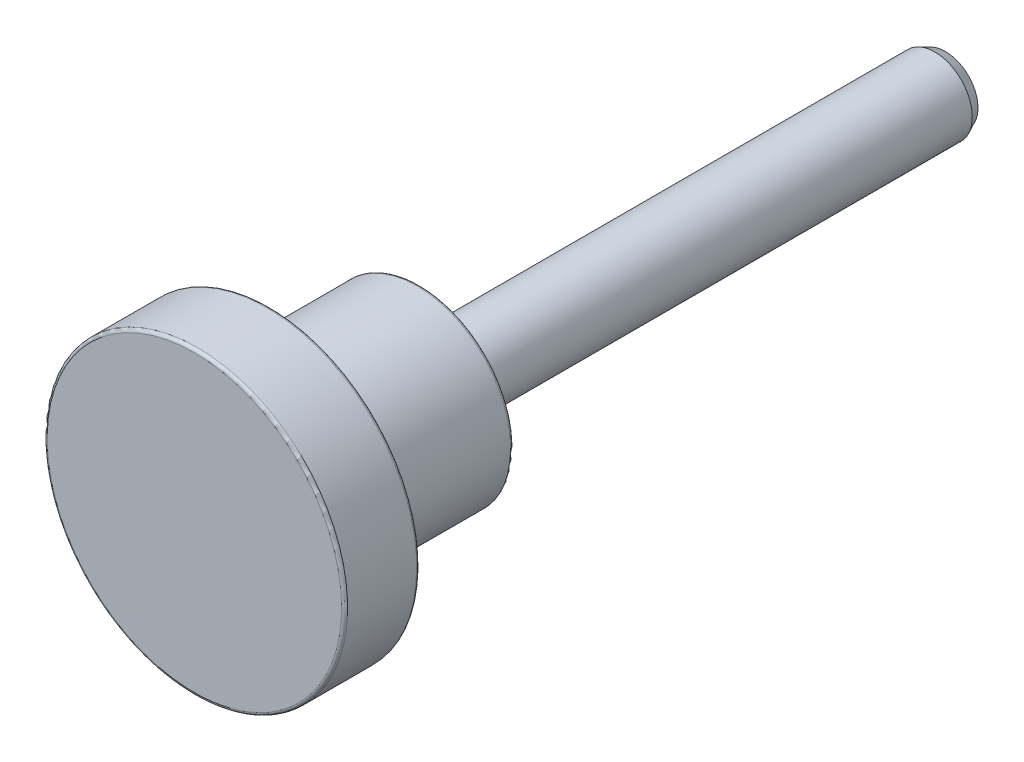
ISO-10303-21;
HEADER;
FILE_DESCRIPTION(('STEP AP214'),'2;1');
FILE_NAME('part.step','',(''),(''),'','','');
FILE_SCHEMA(('AUTOMOTIVE_DESIGN { 1 0 10303 214 1 1 1 1 }'));
ENDSEC;
DATA;
#1=APPLICATION_CONTEXT('core data for automotive mechanical design processes');
#2=APPLICATION_PROTOCOL_DEFINITION('international standard','automotive_design',2000,#1);
#3=PRODUCT_CONTEXT('',#1,'mechanical');
#4=PRODUCT('Part','Part','',(#3));
#5=PRODUCT_RELATED_PRODUCT_CATEGORY('part','',(#4));
#6=PRODUCT_DEFINITION_FORMATION('','',#4);
#7=PRODUCT_DEFINITION_CONTEXT('part definition',#1,'design');
#8=PRODUCT_DEFINITION('design','',#6,#7);
#9=PRODUCT_DEFINITION_SHAPE('','',#8);
#10=(LENGTH_UNIT() NAMED_UNIT(*) SI_UNIT(.MILLI.,.METRE.));
#11=(NAMED_UNIT(*) PLANE_ANGLE_UNIT() SI_UNIT($,.RADIAN.));
#12=(NAMED_UNIT(*) SI_UNIT($,.STERADIAN.) SOLID_ANGLE_UNIT());
#13=UNCERTAINTY_MEASURE_WITH_UNIT(LENGTH_MEASURE(1.E-05),#10,'distance_accuracy_value','');
#14=(GEOMETRIC_REPRESENTATION_CONTEXT(3) GLOBAL_UNCERTAINTY_ASSIGNED_CONTEXT((#13)) GLOBAL_UNIT_ASSIGNED_CONTEXT((#10,
#11,#12)) REPRESENTATION_CONTEXT('',''));
#15=CARTESIAN_POINT('',(0.,0.,0.));
#16=DIRECTION('',(0.,0.,1.));
#17=DIRECTION('',(1.,0.,0.));
#18=AXIS2_PLACEMENT_3D('',#15,#16,#17);
#19=CARTESIAN_POINT('',(0.,0.,8.5598));
#20=DIRECTION('',(0.,0.,-1.));
#21=DIRECTION('',(0.,1.,0.));
#22=AXIS2_PLACEMENT_3D('',#19,#20,#21);
#23=CYLINDRICAL_SURFACE('',#22,3.175);
#24=CARTESIAN_POINT('',(0.,0.,22.225));
#25=DIRECTION('',(0.,0.,1.));
#26=DIRECTION('',(0.,-1.,0.));
#27=AXIS2_PLACEMENT_3D('',#24,#25,#26);
#28=CIRCLE('',#27,3.175);
#29=CARTESIAN_POINT('',(0.,-3.175,22.225));
#30=VERTEX_POINT('',#29);
#31=EDGE_CURVE('E62',#30,#30,#28,.F.);
#32=ORIENTED_EDGE('',*,*,#31,.T.);
#33=EDGE_LOOP('',(#32));
#34=FACE_BOUND('',#33,.T.);
#35=CARTESIAN_POINT('',(0.,0.,-21.3178571428572));
#36=DIRECTION('',(0.,0.,1.));
#37=DIRECTION('',(0.,-1.,0.));
#38=AXIS2_PLACEMENT_3D('',#35,#36,#37);
#39=CIRCLE('',#38,3.175);
#40=CARTESIAN_POINT('',(0.,-3.17500000000001,-21.3178571428572));
#41=VERTEX_POINT('',#40);
#42=EDGE_CURVE('E71',#41,#41,#39,.T.);
#43=ORIENTED_EDGE('',*,*,#42,.T.);
#44=EDGE_LOOP('',(#43));
#45=FACE_BOUND('',#44,.T.);
#46=ADVANCED_FACE('F36',(#34,#45),#23,.T.);
#47=CARTESIAN_POINT('',(0.,7.9375,22.225));
#48=DIRECTION('',(0.,0.,1.));
#49=DIRECTION('',(0.,-1.,0.));
#50=AXIS2_PLACEMENT_3D('',#47,#48,#49);
#51=PLANE('',#50);
#52=CARTESIAN_POINT('',(0.,0.,22.225));
#53=DIRECTION('',(0.,0.,1.));
#54=DIRECTION('',(0.,-1.,0.));
#55=AXIS2_PLACEMENT_3D('',#52,#53,#54);
#56=CIRCLE('',#55,7.6835);
#57=CARTESIAN_POINT('',(0.,-7.6835,22.225));
#58=VERTEX_POINT('',#57);
#59=EDGE_CURVE('E56',#58,#58,#56,.F.);
#60=ORIENTED_EDGE('',*,*,#59,.T.);
#61=EDGE_LOOP('',(#60));
#62=FACE_BOUND('',#61,.T.);
#63=ORIENTED_EDGE('',*,*,#31,.F.);
#64=EDGE_LOOP('',(#63));
#65=FACE_BOUND('',#64,.T.);
#66=ADVANCED_FACE('F92',(#62,#65),#51,.F.);
#67=CARTESIAN_POINT('',(0.,0.,22.225));
#68=DIRECTION('',(0.,0.,1.));
#69=DIRECTION('',(0.,-1.,0.));
#70=AXIS2_PLACEMENT_3D('',#67,#68,#69);
#71=CYLINDRICAL_SURFACE('',#70,7.9375);
#72=CARTESIAN_POINT('',(0.,0.,22.479));
#73=DIRECTION('',(0.,0.,1.));
#74=DIRECTION('',(0.,-1.,0.));
#75=AXIS2_PLACEMENT_3D('',#72,#73,#74);
#76=CIRCLE('',#75,7.9375);
#77=CARTESIAN_POINT('',(0.,-7.9375,22.479));
#78=VERTEX_POINT('',#77);
#79=EDGE_CURVE('E59',#78,#78,#76,.T.);
#80=ORIENTED_EDGE('',*,*,#79,.T.);
#81=EDGE_LOOP('',(#80));
#82=FACE_BOUND('',#81,.T.);
#83=CARTESIAN_POINT('',(0.,0.,34.925));
#84=DIRECTION('',(0.,0.,1.));
#85=DIRECTION('',(0.,-1.,0.));
#86=AXIS2_PLACEMENT_3D('',#83,#84,#85);
#87=CIRCLE('',#86,7.9375);
#88=CARTESIAN_POINT('',(0.,-7.9375,34.925));
#89=VERTEX_POINT('',#88);
#90=EDGE_CURVE('E65',#89,#89,#87,.T.);
#91=ORIENTED_EDGE('',*,*,#90,.F.);
#92=EDGE_LOOP('',(#91));
#93=FACE_BOUND('',#92,.T.);
#94=ADVANCED_FACE('F98',(#82,#93),#71,.T.);
#95=CARTESIAN_POINT('',(0.,7.9375,34.925));
#96=DIRECTION('',(0.,0.,1.));
#97=DIRECTION('',(0.,-1.,0.));
#98=AXIS2_PLACEMENT_3D('',#95,#96,#97);
#99=PLANE('',#98);
#100=CARTESIAN_POINT('',(0.,0.,34.925));
#101=DIRECTION('',(0.,0.,1.));
#102=DIRECTION('',(0.,-1.,0.));
#103=AXIS2_PLACEMENT_3D('',#100,#101,#102);
#104=CIRCLE('',#103,12.446);
#105=CARTESIAN_POINT('',(0.,-12.446,34.925));
#106=VERTEX_POINT('',#105);
#107=EDGE_CURVE('E43',#106,#106,#104,.F.);
#108=ORIENTED_EDGE('',*,*,#107,.T.);
#109=EDGE_LOOP('',(#108));
#110=FACE_BOUND('',#109,.T.);
#111=ORIENTED_EDGE('',*,*,#90,.T.);
#112=EDGE_LOOP('',(#111));
#113=FACE_BOUND('',#112,.T.);
#114=ADVANCED_FACE('F117',(#110,#113),#99,.F.);
#115=CARTESIAN_POINT('',(0.,0.,22.225));
#116=DIRECTION('',(0.,0.,1.));
#117=DIRECTION('',(0.,-1.,0.));
#118=AXIS2_PLACEMENT_3D('',#115,#116,#117);
#119=CYLINDRICAL_SURFACE('',#118,12.7);
#120=CARTESIAN_POINT('',(0.,0.,35.179));
#121=DIRECTION('',(0.,0.,1.));
#122=DIRECTION('',(0.,-1.,0.));
#123=AXIS2_PLACEMENT_3D('',#120,#121,#122);
#124=CIRCLE('',#123,12.7);
#125=CARTESIAN_POINT('',(0.,-12.7,35.179));
#126=VERTEX_POINT('',#125);
#127=EDGE_CURVE('E47',#126,#126,#124,.T.);
#128=ORIENTED_EDGE('',*,*,#127,.T.);
#129=EDGE_LOOP('',(#128));
#130=FACE_BOUND('',#129,.T.);
#131=CARTESIAN_POINT('',(0.,0.,41.021));
#132=DIRECTION('',(0.,0.,-1.));
#133=DIRECTION('',(0.,1.,0.));
#134=AXIS2_PLACEMENT_3D('',#131,#132,#133);
#135=CIRCLE('',#134,12.7);
#136=CARTESIAN_POINT('',(0.,12.7,41.021));
#137=VERTEX_POINT('',#136);
#138=EDGE_CURVE('E51',#137,#137,#135,.T.);
#139=ORIENTED_EDGE('',*,*,#138,.T.);
#140=EDGE_LOOP('',(#139));
#141=FACE_BOUND('',#140,.T.);
#142=ADVANCED_FACE('F89',(#130,#141),#119,.T.);
#143=CARTESIAN_POINT('',(0.,12.7,41.275));
#144=DIRECTION('',(0.,0.,-1.));
#145=DIRECTION('',(0.,1.,0.));
#146=AXIS2_PLACEMENT_3D('',#143,#144,#145);
#147=PLANE('',#146);
#148=CARTESIAN_POINT('',(0.,0.,41.275));
#149=DIRECTION('',(0.,0.,-1.));
#150=DIRECTION('',(0.,1.,0.));
#151=AXIS2_PLACEMENT_3D('',#148,#149,#150);
#152=CIRCLE('',#151,12.446);
#153=CARTESIAN_POINT('',(0.,12.446,41.275));
#154=VERTEX_POINT('',#153);
#155=EDGE_CURVE('E11',#154,#154,#152,.F.);
#156=ORIENTED_EDGE('',*,*,#155,.T.);
#157=EDGE_LOOP('',(#156));
#158=FACE_BOUND('',#157,.T.);
#159=ADVANCED_FACE('F79',(#158),#147,.F.);
#160=CARTESIAN_POINT('',(0.,0.,-21.3178571428572));
#161=DIRECTION('',(0.,0.,1.));
#162=DIRECTION('',(0.,-1.,0.));
#163=AXIS2_PLACEMENT_3D('',#160,#161,#162);
#164=CONICAL_SURFACE('',#163,3.175,0.436332312998576);
#165=CARTESIAN_POINT('',(0.,0.,-22.225));
#166=DIRECTION('',(0.,0.,1.));
#167=DIRECTION('',(0.,-1.,0.));
#168=AXIS2_PLACEMENT_3D('',#165,#166,#167);
#169=CIRCLE('',#168,2.75199233867369);
#170=CARTESIAN_POINT('',(0.,-2.75199233867369,-22.225));
#171=VERTEX_POINT('',#170);
#172=EDGE_CURVE('E68',#171,#171,#169,.T.);
#173=ORIENTED_EDGE('',*,*,#172,.T.);
#174=EDGE_LOOP('',(#173));
#175=FACE_BOUND('',#174,.T.);
#176=ORIENTED_EDGE('',*,*,#42,.F.);
#177=EDGE_LOOP('',(#176));
#178=FACE_BOUND('',#177,.T.);
#179=ADVANCED_FACE('F76',(#175,#178),#164,.T.);
#180=CARTESIAN_POINT('',(0.,3.175,-22.225));
#181=DIRECTION('',(0.,0.,-1.));
#182=DIRECTION('',(0.,1.,0.));
#183=AXIS2_PLACEMENT_3D('',#180,#181,#182);
#184=PLANE('',#183);
#185=ORIENTED_EDGE('',*,*,#172,.F.);
#186=EDGE_LOOP('',(#185));
#187=FACE_BOUND('',#186,.T.);
#188=ADVANCED_FACE('F78',(#187),#184,.T.);
#189=CARTESIAN_POINT('',(0.,0.,22.479));
#190=DIRECTION('',(0.,0.,1.));
#191=DIRECTION('',(0.,-1.,0.));
#192=AXIS2_PLACEMENT_3D('',#189,#190,#191);
#193=TOROIDAL_SURFACE('',#192,7.6835,0.254);
#194=ORIENTED_EDGE('',*,*,#59,.F.);
#195=EDGE_LOOP('',(#194));
#196=FACE_BOUND('',#195,.T.);
#197=ORIENTED_EDGE('',*,*,#79,.F.);
#198=EDGE_LOOP('',(#197));
#199=FACE_BOUND('',#198,.T.);
#200=ADVANCED_FACE('F86',(#196,#199),#193,.T.);
#201=CARTESIAN_POINT('',(0.,0.,35.179));
#202=DIRECTION('',(0.,0.,1.));
#203=DIRECTION('',(0.,-1.,0.));
#204=AXIS2_PLACEMENT_3D('',#201,#202,#203);
#205=TOROIDAL_SURFACE('',#204,12.446,0.254);
#206=ORIENTED_EDGE('',*,*,#107,.F.);
#207=EDGE_LOOP('',(#206));
#208=FACE_BOUND('',#207,.T.);
#209=ORIENTED_EDGE('',*,*,#127,.F.);
#210=EDGE_LOOP('',(#209));
#211=FACE_BOUND('',#210,.T.);
#212=ADVANCED_FACE('F104',(#208,#211),#205,.T.);
#213=CARTESIAN_POINT('',(0.,0.,41.021));
#214=DIRECTION('',(0.,0.,-1.));
#215=DIRECTION('',(0.,1.,0.));
#216=AXIS2_PLACEMENT_3D('',#213,#214,#215);
#217=TOROIDAL_SURFACE('',#216,12.446,0.254);
#218=ORIENTED_EDGE('',*,*,#138,.F.);
#219=EDGE_LOOP('',(#218));
#220=FACE_BOUND('',#219,.T.);
#221=ORIENTED_EDGE('',*,*,#155,.F.);
#222=EDGE_LOOP('',(#221));
#223=FACE_BOUND('',#222,.T.);
#224=ADVANCED_FACE('F38',(#220,#223),#217,.T.);
#225=CLOSED_SHELL('',(#46,#66,#94,#114,#142,#159,#179,#188,#200,#212,#224));
#226=MANIFOLD_SOLID_BREP('B2',#225);
#227=ADVANCED_BREP_SHAPE_REPRESENTATION('',(#18,#226),#14);
#228=SHAPE_DEFINITION_REPRESENTATION(#9,#227);
ENDSEC;
END-ISO-10303-21;
